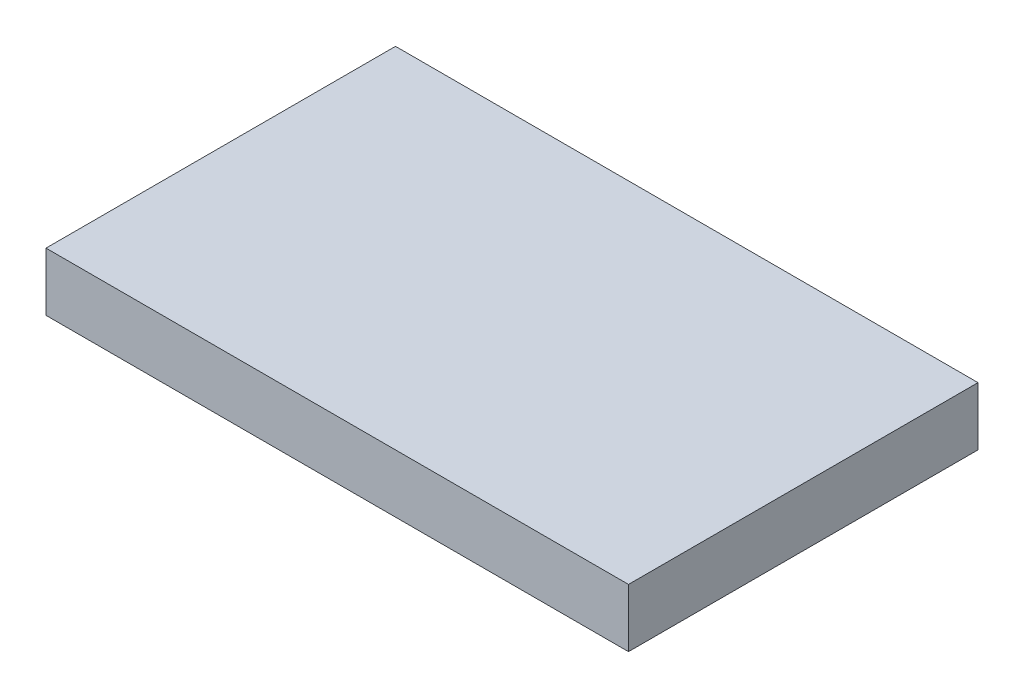
ISO-10303-21;
HEADER;
FILE_DESCRIPTION(('STEP AP214'),'2;1');
FILE_NAME('part.step','',(''),(''),'','','');
FILE_SCHEMA(('AUTOMOTIVE_DESIGN { 1 0 10303 214 1 1 1 1 }'));
ENDSEC;
DATA;
#1=APPLICATION_CONTEXT('core data for automotive mechanical design processes');
#2=APPLICATION_PROTOCOL_DEFINITION('international standard','automotive_design',2000,#1);
#3=PRODUCT_CONTEXT('',#1,'mechanical');
#4=PRODUCT('Part','Part','',(#3));
#5=PRODUCT_RELATED_PRODUCT_CATEGORY('part','',(#4));
#6=PRODUCT_DEFINITION_FORMATION('','',#4);
#7=PRODUCT_DEFINITION_CONTEXT('part definition',#1,'design');
#8=PRODUCT_DEFINITION('design','',#6,#7);
#9=PRODUCT_DEFINITION_SHAPE('','',#8);
#10=(LENGTH_UNIT() NAMED_UNIT(*) SI_UNIT(.MILLI.,.METRE.));
#11=(NAMED_UNIT(*) PLANE_ANGLE_UNIT() SI_UNIT($,.RADIAN.));
#12=(NAMED_UNIT(*) SI_UNIT($,.STERADIAN.) SOLID_ANGLE_UNIT());
#13=UNCERTAINTY_MEASURE_WITH_UNIT(LENGTH_MEASURE(1.E-05),#10,'distance_accuracy_value','');
#14=(GEOMETRIC_REPRESENTATION_CONTEXT(3) GLOBAL_UNCERTAINTY_ASSIGNED_CONTEXT((#13)) GLOBAL_UNIT_ASSIGNED_CONTEXT((#10,
#11,#12)) REPRESENTATION_CONTEXT('',''));
#15=CARTESIAN_POINT('',(0.,0.,0.));
#16=DIRECTION('',(0.,0.,1.));
#17=DIRECTION('',(1.,0.,0.));
#18=AXIS2_PLACEMENT_3D('',#15,#16,#17);
#19=CARTESIAN_POINT('',(0.,12.7,0.));
#20=DIRECTION('',(1.,0.,0.));
#21=DIRECTION('',(0.,0.,-1.));
#22=AXIS2_PLACEMENT_3D('',#19,#20,#21);
#23=PLANE('',#22);
#24=DIRECTION('',(0.,0.,1.));
#25=VECTOR('',#24,1.);
#26=CARTESIAN_POINT('',(0.,0.,0.));
#27=LINE('',#26,#25);
#28=CARTESIAN_POINT('',(0.,0.,-76.2));
#29=VERTEX_POINT('',#28);
#30=CARTESIAN_POINT('',(0.,0.,0.));
#31=VERTEX_POINT('',#30);
#32=EDGE_CURVE('E96',#29,#31,#27,.T.);
#33=ORIENTED_EDGE('',*,*,#32,.T.);
#34=DIRECTION('',(0.,-1.,0.));
#35=VECTOR('',#34,1.);
#36=CARTESIAN_POINT('',(0.,12.7,0.));
#37=LINE('',#36,#35);
#38=CARTESIAN_POINT('',(0.,12.7,0.));
#39=VERTEX_POINT('',#38);
#40=EDGE_CURVE('E11',#39,#31,#37,.T.);
#41=ORIENTED_EDGE('',*,*,#40,.F.);
#42=DIRECTION('',(0.,0.,1.));
#43=VECTOR('',#42,1.);
#44=CARTESIAN_POINT('',(0.,12.7,0.));
#45=LINE('',#44,#43);
#46=CARTESIAN_POINT('',(0.,12.7,-76.2));
#47=VERTEX_POINT('',#46);
#48=EDGE_CURVE('E84',#47,#39,#45,.T.);
#49=ORIENTED_EDGE('',*,*,#48,.F.);
#50=DIRECTION('',(0.,-1.,0.));
#51=VECTOR('',#50,1.);
#52=CARTESIAN_POINT('',(0.,12.7,-76.2));
#53=LINE('',#52,#51);
#54=EDGE_CURVE('E92',#47,#29,#53,.T.);
#55=ORIENTED_EDGE('',*,*,#54,.T.);
#56=EDGE_LOOP('',(#33,#41,#49,#55));
#57=FACE_BOUND('',#56,.T.);
#58=ADVANCED_FACE('F33',(#57),#23,.F.);
#59=CARTESIAN_POINT('',(0.,12.7,0.));
#60=DIRECTION('',(0.,0.,-1.));
#61=DIRECTION('',(-1.,0.,0.));
#62=AXIS2_PLACEMENT_3D('',#59,#60,#61);
#63=PLANE('',#62);
#64=DIRECTION('',(1.,0.,0.));
#65=VECTOR('',#64,1.);
#66=CARTESIAN_POINT('',(0.,0.,0.));
#67=LINE('',#66,#65);
#68=CARTESIAN_POINT('',(127.,0.,0.));
#69=VERTEX_POINT('',#68);
#70=EDGE_CURVE('E88',#31,#69,#67,.T.);
#71=ORIENTED_EDGE('',*,*,#70,.T.);
#72=DIRECTION('',(0.,-1.,0.));
#73=VECTOR('',#72,1.);
#74=CARTESIAN_POINT('',(127.,12.7,0.));
#75=LINE('',#74,#73);
#76=CARTESIAN_POINT('',(127.,12.7,0.));
#77=VERTEX_POINT('',#76);
#78=EDGE_CURVE('E41',#77,#69,#75,.T.);
#79=ORIENTED_EDGE('',*,*,#78,.F.);
#80=DIRECTION('',(1.,0.,0.));
#81=VECTOR('',#80,1.);
#82=CARTESIAN_POINT('',(0.,12.7,0.));
#83=LINE('',#82,#81);
#84=EDGE_CURVE('E79',#39,#77,#83,.T.);
#85=ORIENTED_EDGE('',*,*,#84,.F.);
#86=ORIENTED_EDGE('',*,*,#40,.T.);
#87=EDGE_LOOP('',(#71,#79,#85,#86));
#88=FACE_BOUND('',#87,.T.);
#89=ADVANCED_FACE('F87',(#88),#63,.F.);
#90=CARTESIAN_POINT('',(127.,12.7,0.));
#91=DIRECTION('',(-1.,0.,0.));
#92=DIRECTION('',(0.,0.,1.));
#93=AXIS2_PLACEMENT_3D('',#90,#91,#92);
#94=PLANE('',#93);
#95=DIRECTION('',(0.,0.,-1.));
#96=VECTOR('',#95,1.);
#97=CARTESIAN_POINT('',(127.,0.,0.));
#98=LINE('',#97,#96);
#99=CARTESIAN_POINT('',(127.,0.,-76.2));
#100=VERTEX_POINT('',#99);
#101=EDGE_CURVE('E66',#69,#100,#98,.T.);
#102=ORIENTED_EDGE('',*,*,#101,.T.);
#103=DIRECTION('',(0.,-1.,0.));
#104=VECTOR('',#103,1.);
#105=CARTESIAN_POINT('',(127.,12.7,-76.2));
#106=LINE('',#105,#104);
#107=CARTESIAN_POINT('',(127.,12.7,-76.2));
#108=VERTEX_POINT('',#107);
#109=EDGE_CURVE('E89',#108,#100,#106,.T.);
#110=ORIENTED_EDGE('',*,*,#109,.F.);
#111=DIRECTION('',(0.,0.,-1.));
#112=VECTOR('',#111,1.);
#113=CARTESIAN_POINT('',(127.,12.7,0.));
#114=LINE('',#113,#112);
#115=EDGE_CURVE('E82',#77,#108,#114,.T.);
#116=ORIENTED_EDGE('',*,*,#115,.F.);
#117=ORIENTED_EDGE('',*,*,#78,.T.);
#118=EDGE_LOOP('',(#102,#110,#116,#117));
#119=FACE_BOUND('',#118,.T.);
#120=ADVANCED_FACE('F90',(#119),#94,.F.);
#121=CARTESIAN_POINT('',(0.,12.7,-76.2));
#122=DIRECTION('',(0.,0.,1.));
#123=DIRECTION('',(1.,0.,0.));
#124=AXIS2_PLACEMENT_3D('',#121,#122,#123);
#125=PLANE('',#124);
#126=DIRECTION('',(-1.,0.,0.));
#127=VECTOR('',#126,1.);
#128=CARTESIAN_POINT('',(0.,0.,-76.2));
#129=LINE('',#128,#127);
#130=EDGE_CURVE('E72',#100,#29,#129,.T.);
#131=ORIENTED_EDGE('',*,*,#130,.T.);
#132=ORIENTED_EDGE('',*,*,#54,.F.);
#133=DIRECTION('',(-1.,0.,0.));
#134=VECTOR('',#133,1.);
#135=CARTESIAN_POINT('',(0.,12.7,-76.2));
#136=LINE('',#135,#134);
#137=EDGE_CURVE('E49',#108,#47,#136,.T.);
#138=ORIENTED_EDGE('',*,*,#137,.F.);
#139=ORIENTED_EDGE('',*,*,#109,.T.);
#140=EDGE_LOOP('',(#131,#132,#138,#139));
#141=FACE_BOUND('',#140,.T.);
#142=ADVANCED_FACE('F103',(#141),#125,.F.);
#143=CARTESIAN_POINT('',(0.,12.7,0.));
#144=DIRECTION('',(0.,-1.,0.));
#145=DIRECTION('',(0.,0.,-1.));
#146=AXIS2_PLACEMENT_3D('',#143,#144,#145);
#147=PLANE('',#146);
#148=ORIENTED_EDGE('',*,*,#48,.T.);
#149=ORIENTED_EDGE('',*,*,#84,.T.);
#150=ORIENTED_EDGE('',*,*,#115,.T.);
#151=ORIENTED_EDGE('',*,*,#137,.T.);
#152=EDGE_LOOP('',(#148,#149,#150,#151));
#153=FACE_BOUND('',#152,.T.);
#154=ADVANCED_FACE('F80',(#153),#147,.F.);
#155=CARTESIAN_POINT('',(0.,0.,0.));
#156=DIRECTION('',(0.,-1.,0.));
#157=DIRECTION('',(0.,0.,-1.));
#158=AXIS2_PLACEMENT_3D('',#155,#156,#157);
#159=PLANE('',#158);
#160=ORIENTED_EDGE('',*,*,#32,.F.);
#161=ORIENTED_EDGE('',*,*,#130,.F.);
#162=ORIENTED_EDGE('',*,*,#101,.F.);
#163=ORIENTED_EDGE('',*,*,#70,.F.);
#164=EDGE_LOOP('',(#160,#161,#162,#163));
#165=FACE_BOUND('',#164,.T.);
#166=ADVANCED_FACE('F106',(#165),#159,.T.);
#167=CLOSED_SHELL('',(#58,#89,#120,#142,#154,#166));
#168=MANIFOLD_SOLID_BREP('B2',#167);
#169=ADVANCED_BREP_SHAPE_REPRESENTATION('',(#18,#168),#14);
#170=SHAPE_DEFINITION_REPRESENTATION(#9,#169);
ENDSEC;
END-ISO-10303-21;
